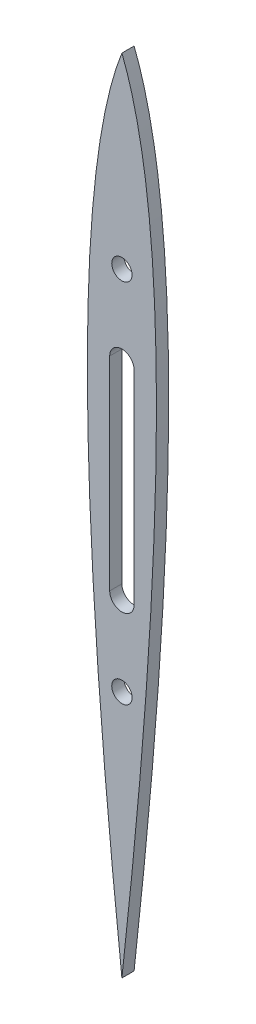
ISO-10303-21;
HEADER;
FILE_DESCRIPTION(('STEP AP214'),'2;1');
FILE_NAME('part.step','',(''),(''),'','','');
FILE_SCHEMA(('AUTOMOTIVE_DESIGN { 1 0 10303 214 1 1 1 1 }'));
ENDSEC;
DATA;
#1=APPLICATION_CONTEXT('core data for automotive mechanical design processes');
#2=APPLICATION_PROTOCOL_DEFINITION('international standard','automotive_design',2000,#1);
#3=PRODUCT_CONTEXT('',#1,'mechanical');
#4=PRODUCT('Part','Part','',(#3));
#5=PRODUCT_RELATED_PRODUCT_CATEGORY('part','',(#4));
#6=PRODUCT_DEFINITION_FORMATION('','',#4);
#7=PRODUCT_DEFINITION_CONTEXT('part definition',#1,'design');
#8=PRODUCT_DEFINITION('design','',#6,#7);
#9=PRODUCT_DEFINITION_SHAPE('','',#8);
#10=(LENGTH_UNIT() NAMED_UNIT(*) SI_UNIT(.MILLI.,.METRE.));
#11=(NAMED_UNIT(*) PLANE_ANGLE_UNIT() SI_UNIT($,.RADIAN.));
#12=(NAMED_UNIT(*) SI_UNIT($,.STERADIAN.) SOLID_ANGLE_UNIT());
#13=UNCERTAINTY_MEASURE_WITH_UNIT(LENGTH_MEASURE(1.E-05),#10,'distance_accuracy_value','');
#14=(GEOMETRIC_REPRESENTATION_CONTEXT(3) GLOBAL_UNCERTAINTY_ASSIGNED_CONTEXT((#13)) GLOBAL_UNIT_ASSIGNED_CONTEXT((#10,
#11,#12)) REPRESENTATION_CONTEXT('',''));
#15=CARTESIAN_POINT('',(0.,0.,0.));
#16=DIRECTION('',(0.,0.,1.));
#17=DIRECTION('',(1.,0.,0.));
#18=AXIS2_PLACEMENT_3D('',#15,#16,#17);
#19=CARTESIAN_POINT('',(-10.7943995780546,51.7617177266324,3.81));
#20=DIRECTION('',(0.,0.,1.));
#21=DIRECTION('',(1.,0.,0.));
#22=AXIS2_PLACEMENT_3D('',#19,#20,#21);
#23=PLANE('',#22);
#24=DIRECTION('',(0.,-1.,0.));
#25=VECTOR('',#24,1.);
#26=CARTESIAN_POINT('',(-3.81,57.15,3.81));
#27=LINE('',#26,#25);
#28=CARTESIAN_POINT('',(-3.81,57.15,3.81));
#29=VERTEX_POINT('',#28);
#30=CARTESIAN_POINT('',(-3.80999999999998,-6.35,3.81));
#31=VERTEX_POINT('',#30);
#32=EDGE_CURVE('E103',#29,#31,#27,.T.);
#33=ORIENTED_EDGE('',*,*,#32,.F.);
#34=CARTESIAN_POINT('',(0.,57.15,3.81));
#35=DIRECTION('',(0.,0.,1.));
#36=DIRECTION('',(1.,0.,0.));
#37=AXIS2_PLACEMENT_3D('',#34,#35,#36);
#38=CIRCLE('',#37,3.80999999999999);
#39=CARTESIAN_POINT('',(3.80999999999998,57.15,3.81));
#40=VERTEX_POINT('',#39);
#41=EDGE_CURVE('E94',#40,#29,#38,.T.);
#42=ORIENTED_EDGE('',*,*,#41,.F.);
#43=DIRECTION('',(0.,1.,0.));
#44=VECTOR('',#43,1.);
#45=CARTESIAN_POINT('',(3.80999999999998,57.15,3.81));
#46=LINE('',#45,#44);
#47=CARTESIAN_POINT('',(3.81,-6.35,3.81));
#48=VERTEX_POINT('',#47);
#49=EDGE_CURVE('E121',#48,#40,#46,.T.);
#50=ORIENTED_EDGE('',*,*,#49,.F.);
#51=CARTESIAN_POINT('',(0.,-6.35,3.81));
#52=DIRECTION('',(0.,0.,1.));
#53=DIRECTION('',(1.,0.,0.));
#54=AXIS2_PLACEMENT_3D('',#51,#52,#53);
#55=CIRCLE('',#54,3.80999999999999);
#56=EDGE_CURVE('E117',#31,#48,#55,.T.);
#57=ORIENTED_EDGE('',*,*,#56,.F.);
#58=EDGE_LOOP('',(#33,#42,#50,#57));
#59=FACE_BOUND('',#58,.T.);
#60=CARTESIAN_POINT('',(0.,-31.75,3.81));
#61=DIRECTION('',(0.,0.,1.));
#62=DIRECTION('',(1.,0.,0.));
#63=AXIS2_PLACEMENT_3D('',#60,#61,#62);
#64=CIRCLE('',#63,3.175);
#65=CARTESIAN_POINT('',(-3.175,-31.75,3.81));
#66=VERTEX_POINT('',#65);
#67=EDGE_CURVE('E145',#66,#66,#64,.T.);
#68=ORIENTED_EDGE('',*,*,#67,.F.);
#69=EDGE_LOOP('',(#68));
#70=FACE_BOUND('',#69,.T.);
#71=CARTESIAN_POINT('',(0.,140.978035644635,3.81));
#72=CARTESIAN_POINT('',(-3.91848207404643,131.156065716608,3.81));
#73=CARTESIAN_POINT('',(-8.16937817155045,106.055563129853,3.81));
#74=CARTESIAN_POINT('',(-10.2425746417,81.4333456049166,3.81));
#75=CARTESIAN_POINT('',(-11.1456655969047,45.0401668444737,3.81));
#76=CARTESIAN_POINT('',(-8.16373796542806,-35.5088464124318,3.81));
#77=CARTESIAN_POINT('',(0.,-109.125318419714,3.81));
#78=B_SPLINE_CURVE_WITH_KNOTS('',2,(#71,#72,#73,#74,#75,#76,#77),.UNSPECIFIED.,.F.,.F.,(3,1,1,1,
1,3),(0.0455268147428228,0.207530569666544,0.315533072949025,0.423535576231506,
0.585539331155228,0.909546841002671),.UNSPECIFIED.);
#79=CARTESIAN_POINT('',(0.,140.978035644634,3.81));
#80=VERTEX_POINT('',#79);
#81=CARTESIAN_POINT('',(0.,-109.125318419714,3.81));
#82=VERTEX_POINT('',#81);
#83=EDGE_CURVE('E152',#80,#82,#78,.T.);
#84=ORIENTED_EDGE('',*,*,#83,.T.);
#85=CARTESIAN_POINT('',(0.,-109.125318419714,3.81));
#86=CARTESIAN_POINT('',(8.16373796542807,-35.5088464124318,3.81));
#87=CARTESIAN_POINT('',(11.1456655969047,45.0401668444738,3.81));
#88=CARTESIAN_POINT('',(10.2425746417,81.4333456049166,3.81));
#89=CARTESIAN_POINT('',(8.16937817155045,106.055563129854,3.81));
#90=CARTESIAN_POINT('',(3.91848207404641,131.156065716608,3.81));
#91=CARTESIAN_POINT('',(0.,140.978035644634,3.81));
#92=B_SPLINE_CURVE_WITH_KNOTS('',2,(#85,#86,#87,#88,#89,#90,#91),.UNSPECIFIED.,.F.,.F.,(3,1,1,1,
1,3),(0.0455268147428226,0.369534324590266,0.531538079513987,0.639540582796468,
0.747543086078949,0.909546841002671),.UNSPECIFIED.);
#93=EDGE_CURVE('E159',#82,#80,#92,.T.);
#94=ORIENTED_EDGE('',*,*,#93,.T.);
#95=EDGE_LOOP('',(#84,#94));
#96=FACE_BOUND('',#95,.T.);
#97=CARTESIAN_POINT('',(0.,82.55,3.81));
#98=DIRECTION('',(0.,0.,1.));
#99=DIRECTION('',(1.,0.,0.));
#100=AXIS2_PLACEMENT_3D('',#97,#98,#99);
#101=CIRCLE('',#100,3.175);
#102=CARTESIAN_POINT('',(-3.175,82.55,3.81));
#103=VERTEX_POINT('',#102);
#104=EDGE_CURVE('E129',#103,#103,#101,.T.);
#105=ORIENTED_EDGE('',*,*,#104,.F.);
#106=EDGE_LOOP('',(#105));
#107=FACE_BOUND('',#106,.T.);
#108=ADVANCED_FACE('F39',(#59,#70,#96,#107),#23,.T.);
#109=CARTESIAN_POINT('',(-10.7943995780546,51.7617177266324,0.));
#110=DIRECTION('',(0.,0.,1.));
#111=DIRECTION('',(1.,0.,0.));
#112=AXIS2_PLACEMENT_3D('',#109,#110,#111);
#113=PLANE('',#112);
#114=CARTESIAN_POINT('',(0.,-31.75,0.));
#115=DIRECTION('',(0.,0.,1.));
#116=DIRECTION('',(1.,0.,0.));
#117=AXIS2_PLACEMENT_3D('',#114,#115,#116);
#118=CIRCLE('',#117,3.175);
#119=CARTESIAN_POINT('',(-3.175,-31.75,0.));
#120=VERTEX_POINT('',#119);
#121=EDGE_CURVE('E112',#120,#120,#118,.T.);
#122=ORIENTED_EDGE('',*,*,#121,.T.);
#123=EDGE_LOOP('',(#122));
#124=FACE_BOUND('',#123,.T.);
#125=CARTESIAN_POINT('',(0.,140.978035644635,0.));
#126=CARTESIAN_POINT('',(-3.91848207404643,131.156065716608,0.));
#127=CARTESIAN_POINT('',(-8.16937817155045,106.055563129853,0.));
#128=CARTESIAN_POINT('',(-10.2425746417,81.4333456049166,0.));
#129=CARTESIAN_POINT('',(-11.1456655969047,45.0401668444737,0.));
#130=CARTESIAN_POINT('',(-8.16373796542806,-35.5088464124318,0.));
#131=CARTESIAN_POINT('',(0.,-109.125318419714,0.));
#132=B_SPLINE_CURVE_WITH_KNOTS('',2,(#125,#126,#127,#128,#129,#130,#131),.UNSPECIFIED.,.F.,.F.,
(3,1,1,1,1,3),(0.0455268147428228,0.207530569666544,0.315533072949025,0.423535576231506,
0.585539331155228,0.909546841002671),.UNSPECIFIED.);
#133=CARTESIAN_POINT('',(0.,140.978035644634,0.));
#134=VERTEX_POINT('',#133);
#135=CARTESIAN_POINT('',(0.,-109.125318419714,0.));
#136=VERTEX_POINT('',#135);
#137=EDGE_CURVE('E149',#134,#136,#132,.T.);
#138=ORIENTED_EDGE('',*,*,#137,.F.);
#139=CARTESIAN_POINT('',(0.,-109.125318419714,0.));
#140=CARTESIAN_POINT('',(8.16373796542807,-35.5088464124318,0.));
#141=CARTESIAN_POINT('',(11.1456655969047,45.0401668444738,0.));
#142=CARTESIAN_POINT('',(10.2425746417,81.4333456049166,0.));
#143=CARTESIAN_POINT('',(8.16937817155045,106.055563129854,0.));
#144=CARTESIAN_POINT('',(3.91848207404641,131.156065716608,0.));
#145=CARTESIAN_POINT('',(0.,140.978035644634,0.));
#146=B_SPLINE_CURVE_WITH_KNOTS('',2,(#139,#140,#141,#142,#143,#144,#145),.UNSPECIFIED.,.F.,.F.,
(3,1,1,1,1,3),(0.0455268147428226,0.369534324590266,0.531538079513987,0.639540582796468,
0.747543086078949,0.909546841002671),.UNSPECIFIED.);
#147=EDGE_CURVE('E160',#136,#134,#146,.T.);
#148=ORIENTED_EDGE('',*,*,#147,.F.);
#149=EDGE_LOOP('',(#138,#148));
#150=FACE_BOUND('',#149,.T.);
#151=CARTESIAN_POINT('',(0.,57.15,0.));
#152=DIRECTION('',(0.,0.,1.));
#153=DIRECTION('',(1.,0.,0.));
#154=AXIS2_PLACEMENT_3D('',#151,#152,#153);
#155=CIRCLE('',#154,3.80999999999999);
#156=CARTESIAN_POINT('',(3.80999999999998,57.15,0.));
#157=VERTEX_POINT('',#156);
#158=CARTESIAN_POINT('',(-3.81,57.15,0.));
#159=VERTEX_POINT('',#158);
#160=EDGE_CURVE('E64',#157,#159,#155,.T.);
#161=ORIENTED_EDGE('',*,*,#160,.T.);
#162=DIRECTION('',(0.,-1.,0.));
#163=VECTOR('',#162,1.);
#164=CARTESIAN_POINT('',(-3.81,57.15,0.));
#165=LINE('',#164,#163);
#166=CARTESIAN_POINT('',(-3.80999999999998,-6.35,0.));
#167=VERTEX_POINT('',#166);
#168=EDGE_CURVE('E110',#159,#167,#165,.T.);
#169=ORIENTED_EDGE('',*,*,#168,.T.);
#170=CARTESIAN_POINT('',(0.,-6.35,0.));
#171=DIRECTION('',(0.,0.,1.));
#172=DIRECTION('',(1.,0.,0.));
#173=AXIS2_PLACEMENT_3D('',#170,#171,#172);
#174=CIRCLE('',#173,3.80999999999999);
#175=CARTESIAN_POINT('',(3.81,-6.35,0.));
#176=VERTEX_POINT('',#175);
#177=EDGE_CURVE('E132',#167,#176,#174,.T.);
#178=ORIENTED_EDGE('',*,*,#177,.T.);
#179=DIRECTION('',(0.,1.,0.));
#180=VECTOR('',#179,1.);
#181=CARTESIAN_POINT('',(3.80999999999998,57.15,0.));
#182=LINE('',#181,#180);
#183=EDGE_CURVE('E104',#176,#157,#182,.T.);
#184=ORIENTED_EDGE('',*,*,#183,.T.);
#185=EDGE_LOOP('',(#161,#169,#178,#184));
#186=FACE_BOUND('',#185,.T.);
#187=CARTESIAN_POINT('',(0.,82.55,0.));
#188=DIRECTION('',(0.,0.,1.));
#189=DIRECTION('',(1.,0.,0.));
#190=AXIS2_PLACEMENT_3D('',#187,#188,#189);
#191=CIRCLE('',#190,3.175);
#192=CARTESIAN_POINT('',(-3.175,82.55,0.));
#193=VERTEX_POINT('',#192);
#194=EDGE_CURVE('E210',#193,#193,#191,.T.);
#195=ORIENTED_EDGE('',*,*,#194,.T.);
#196=EDGE_LOOP('',(#195));
#197=FACE_BOUND('',#196,.T.);
#198=ADVANCED_FACE('F180',(#124,#150,#186,#197),#113,.F.);
#199=DIRECTION('',(0.,0.,-1.));
#200=VECTOR('',#199,1.);
#201=SURFACE_OF_LINEAR_EXTRUSION('',#78,#200);
#202=ORIENTED_EDGE('',*,*,#137,.T.);
#203=DIRECTION('',(0.,0.,-1.));
#204=VECTOR('',#203,1.);
#205=CARTESIAN_POINT('',(0.,-109.125318419714,3.81));
#206=LINE('',#205,#204);
#207=EDGE_CURVE('E11',#82,#136,#206,.T.);
#208=ORIENTED_EDGE('',*,*,#207,.F.);
#209=ORIENTED_EDGE('',*,*,#83,.F.);
#210=DIRECTION('',(0.,0.,-1.));
#211=VECTOR('',#210,1.);
#212=CARTESIAN_POINT('',(0.,140.978035644634,3.81));
#213=LINE('',#212,#211);
#214=EDGE_CURVE('E49',#80,#134,#213,.T.);
#215=ORIENTED_EDGE('',*,*,#214,.T.);
#216=EDGE_LOOP('',(#202,#208,#209,#215));
#217=FACE_BOUND('',#216,.T.);
#218=ADVANCED_FACE('F41',(#217),#201,.F.);
#219=DIRECTION('',(0.,0.,-1.));
#220=VECTOR('',#219,1.);
#221=SURFACE_OF_LINEAR_EXTRUSION('',#92,#220);
#222=ORIENTED_EDGE('',*,*,#147,.T.);
#223=ORIENTED_EDGE('',*,*,#214,.F.);
#224=ORIENTED_EDGE('',*,*,#93,.F.);
#225=ORIENTED_EDGE('',*,*,#207,.T.);
#226=EDGE_LOOP('',(#222,#223,#224,#225));
#227=FACE_BOUND('',#226,.T.);
#228=ADVANCED_FACE('F175',(#227),#221,.F.);
#229=CARTESIAN_POINT('',(0.,-31.75,3.81));
#230=DIRECTION('',(0.,0.,-1.));
#231=DIRECTION('',(-1.,0.,0.));
#232=AXIS2_PLACEMENT_3D('',#229,#230,#231);
#233=CYLINDRICAL_SURFACE('',#232,3.175);
#234=CARTESIAN_POINT('',(-3.175,-31.75,3.81));
#235=CARTESIAN_POINT('',(-3.175,-31.75,3.7703125));
#236=CARTESIAN_POINT('',(-3.175,-31.75,3.730625));
#237=CARTESIAN_POINT('',(-3.175,-31.75,3.65125));
#238=CARTESIAN_POINT('',(-3.175,-31.75,3.6115625));
#239=CARTESIAN_POINT('',(-3.175,-31.75,3.5321875));
#240=CARTESIAN_POINT('',(-3.175,-31.75,3.4925));
#241=CARTESIAN_POINT('',(-3.175,-31.75,3.413125));
#242=CARTESIAN_POINT('',(-3.175,-31.75,3.3734375));
#243=CARTESIAN_POINT('',(-3.175,-31.75,3.2940625));
#244=CARTESIAN_POINT('',(-3.175,-31.75,3.254375));
#245=CARTESIAN_POINT('',(-3.175,-31.75,3.175));
#246=CARTESIAN_POINT('',(-3.175,-31.75,3.1353125));
#247=CARTESIAN_POINT('',(-3.175,-31.75,3.0559375));
#248=CARTESIAN_POINT('',(-3.175,-31.75,3.01625));
#249=CARTESIAN_POINT('',(-3.175,-31.75,2.936875));
#250=CARTESIAN_POINT('',(-3.175,-31.75,2.8971875));
#251=CARTESIAN_POINT('',(-3.175,-31.75,2.8178125));
#252=CARTESIAN_POINT('',(-3.175,-31.75,2.778125));
#253=CARTESIAN_POINT('',(-3.175,-31.75,2.69875));
#254=CARTESIAN_POINT('',(-3.175,-31.75,2.6590625));
#255=CARTESIAN_POINT('',(-3.175,-31.75,2.5796875));
#256=CARTESIAN_POINT('',(-3.175,-31.75,2.54));
#257=CARTESIAN_POINT('',(-3.175,-31.75,2.460625));
#258=CARTESIAN_POINT('',(-3.175,-31.75,2.4209375));
#259=CARTESIAN_POINT('',(-3.175,-31.75,2.3415625));
#260=CARTESIAN_POINT('',(-3.175,-31.75,2.301875));
#261=CARTESIAN_POINT('',(-3.175,-31.75,2.2225));
#262=CARTESIAN_POINT('',(-3.175,-31.75,2.1828125));
#263=CARTESIAN_POINT('',(-3.175,-31.75,2.1034375));
#264=CARTESIAN_POINT('',(-3.175,-31.75,2.06375));
#265=CARTESIAN_POINT('',(-3.175,-31.75,1.984375));
#266=CARTESIAN_POINT('',(-3.175,-31.75,1.9446875));
#267=CARTESIAN_POINT('',(-3.175,-31.75,1.8653125));
#268=CARTESIAN_POINT('',(-3.175,-31.75,1.825625));
#269=CARTESIAN_POINT('',(-3.175,-31.75,1.74625));
#270=CARTESIAN_POINT('',(-3.175,-31.75,1.7065625));
#271=CARTESIAN_POINT('',(-3.175,-31.75,1.6271875));
#272=CARTESIAN_POINT('',(-3.175,-31.75,1.5875));
#273=CARTESIAN_POINT('',(-3.175,-31.75,1.508125));
#274=CARTESIAN_POINT('',(-3.175,-31.75,1.4684375));
#275=CARTESIAN_POINT('',(-3.175,-31.75,1.3890625));
#276=CARTESIAN_POINT('',(-3.175,-31.75,1.349375));
#277=CARTESIAN_POINT('',(-3.175,-31.75,1.27));
#278=CARTESIAN_POINT('',(-3.175,-31.75,1.2303125));
#279=CARTESIAN_POINT('',(-3.175,-31.75,1.1509375));
#280=CARTESIAN_POINT('',(-3.175,-31.75,1.11125));
#281=CARTESIAN_POINT('',(-3.175,-31.75,1.031875));
#282=CARTESIAN_POINT('',(-3.175,-31.75,0.9921875));
#283=CARTESIAN_POINT('',(-3.175,-31.75,0.9128125));
#284=CARTESIAN_POINT('',(-3.175,-31.75,0.873125));
#285=CARTESIAN_POINT('',(-3.175,-31.75,0.79375));
#286=CARTESIAN_POINT('',(-3.175,-31.75,0.7540625));
#287=CARTESIAN_POINT('',(-3.175,-31.75,0.6746875));
#288=CARTESIAN_POINT('',(-3.175,-31.75,0.635));
#289=CARTESIAN_POINT('',(-3.175,-31.75,0.555625));
#290=CARTESIAN_POINT('',(-3.175,-31.75,0.5159375));
#291=CARTESIAN_POINT('',(-3.175,-31.75,0.4365625));
#292=CARTESIAN_POINT('',(-3.175,-31.75,0.396875));
#293=CARTESIAN_POINT('',(-3.175,-31.75,0.3175));
#294=CARTESIAN_POINT('',(-3.175,-31.75,0.2778125));
#295=CARTESIAN_POINT('',(-3.175,-31.75,0.1984375));
#296=CARTESIAN_POINT('',(-3.175,-31.75,0.15875));
#297=CARTESIAN_POINT('',(-3.175,-31.75,0.0793749999999999));
#298=CARTESIAN_POINT('',(-3.175,-31.75,0.0396874999999999));
#299=CARTESIAN_POINT('',(-3.175,-31.75,0.));
#300=B_SPLINE_CURVE_WITH_KNOTS('',3,(#234,#235,#236,#237,#238,#239,#240,#241,#242,#243,#244,
#245,#246,#247,#248,#249,#250,#251,#252,#253,#254,#255,#256,#257,#258,#259,#260,#261,#262,#263,
#264,#265,#266,#267,#268,#269,#270,#271,#272,#273,#274,#275,#276,#277,#278,#279,#280,#281,#282,
#283,#284,#285,#286,#287,#288,#289,#290,#291,#292,#293,#294,#295,#296,#297,#298,#299),
.UNSPECIFIED.,.F.,.F.,(4,2,2,2,2,2,2,2,2,2,2,2,2,2,2,2,2,2,2,2,2,2,2,2,2,2,2,2,2,2,2,2,4),(0.,
0.1190625,0.238125,0.3571875,0.47625,0.595312499999999,0.714375,0.833437499999999,
0.952499999999999,1.0715625,1.190625,1.3096875,1.42875,1.5478125,1.666875,1.7859375,1.905,
2.0240625,2.143125,2.2621875,2.38125,2.5003125,2.619375,2.7384375,2.8575,2.9765625,3.095625,
3.2146875,3.33375,3.4528125,3.571875,3.6909375,3.81),.UNSPECIFIED.);
#301=EDGE_CURVE('BSEAM178',#66,#120,#300,.T.);
#302=ORIENTED_EDGE('',*,*,#67,.T.);
#303=ORIENTED_EDGE('',*,*,#121,.F.);
#304=ORIENTED_EDGE('',*,*,#301,.T.);
#305=ORIENTED_EDGE('',*,*,#301,.F.);
#306=EDGE_LOOP('',(#302,#304,#303,#305));
#307=FACE_BOUND('',#306,.T.);
#308=ADVANCED_FACE('F178',(#307),#233,.F.);
#309=CARTESIAN_POINT('',(0.,57.15,3.81));
#310=DIRECTION('',(0.,0.,-1.));
#311=DIRECTION('',(-1.,0.,0.));
#312=AXIS2_PLACEMENT_3D('',#309,#310,#311);
#313=CYLINDRICAL_SURFACE('',#312,3.80999999999999);
#314=ORIENTED_EDGE('',*,*,#160,.F.);
#315=DIRECTION('',(0.,0.,-1.));
#316=VECTOR('',#315,1.);
#317=CARTESIAN_POINT('',(3.80999999999998,57.15,3.81));
#318=LINE('',#317,#316);
#319=EDGE_CURVE('E98',#40,#157,#318,.T.);
#320=ORIENTED_EDGE('',*,*,#319,.F.);
#321=ORIENTED_EDGE('',*,*,#41,.T.);
#322=DIRECTION('',(0.,0.,-1.));
#323=VECTOR('',#322,1.);
#324=CARTESIAN_POINT('',(-3.81,57.15,3.81));
#325=LINE('',#324,#323);
#326=EDGE_CURVE('E97',#29,#159,#325,.T.);
#327=ORIENTED_EDGE('',*,*,#326,.T.);
#328=EDGE_LOOP('',(#314,#320,#321,#327));
#329=FACE_BOUND('',#328,.T.);
#330=ADVANCED_FACE('F96',(#329),#313,.F.);
#331=CARTESIAN_POINT('',(-3.81,57.15,3.81));
#332=DIRECTION('',(1.,0.,0.));
#333=DIRECTION('',(0.,1.,0.));
#334=AXIS2_PLACEMENT_3D('',#331,#332,#333);
#335=PLANE('',#334);
#336=ORIENTED_EDGE('',*,*,#168,.F.);
#337=ORIENTED_EDGE('',*,*,#326,.F.);
#338=ORIENTED_EDGE('',*,*,#32,.T.);
#339=DIRECTION('',(0.,0.,-1.));
#340=VECTOR('',#339,1.);
#341=CARTESIAN_POINT('',(-3.80999999999998,-6.35,3.81));
#342=LINE('',#341,#340);
#343=EDGE_CURVE('E113',#31,#167,#342,.T.);
#344=ORIENTED_EDGE('',*,*,#343,.T.);
#345=EDGE_LOOP('',(#336,#337,#338,#344));
#346=FACE_BOUND('',#345,.T.);
#347=ADVANCED_FACE('F107',(#346),#335,.T.);
#348=CARTESIAN_POINT('',(0.,-6.35,3.81));
#349=DIRECTION('',(0.,0.,-1.));
#350=DIRECTION('',(-1.,0.,0.));
#351=AXIS2_PLACEMENT_3D('',#348,#349,#350);
#352=CYLINDRICAL_SURFACE('',#351,3.80999999999999);
#353=ORIENTED_EDGE('',*,*,#177,.F.);
#354=ORIENTED_EDGE('',*,*,#343,.F.);
#355=ORIENTED_EDGE('',*,*,#56,.T.);
#356=DIRECTION('',(0.,0.,-1.));
#357=VECTOR('',#356,1.);
#358=CARTESIAN_POINT('',(3.81,-6.35,3.81));
#359=LINE('',#358,#357);
#360=EDGE_CURVE('E56',#48,#176,#359,.T.);
#361=ORIENTED_EDGE('',*,*,#360,.T.);
#362=EDGE_LOOP('',(#353,#354,#355,#361));
#363=FACE_BOUND('',#362,.T.);
#364=ADVANCED_FACE('F193',(#363),#352,.F.);
#365=CARTESIAN_POINT('',(3.80999999999998,57.15,3.81));
#366=DIRECTION('',(-1.,0.,0.));
#367=DIRECTION('',(0.,-1.,0.));
#368=AXIS2_PLACEMENT_3D('',#365,#366,#367);
#369=PLANE('',#368);
#370=ORIENTED_EDGE('',*,*,#183,.F.);
#371=ORIENTED_EDGE('',*,*,#360,.F.);
#372=ORIENTED_EDGE('',*,*,#49,.T.);
#373=ORIENTED_EDGE('',*,*,#319,.T.);
#374=EDGE_LOOP('',(#370,#371,#372,#373));
#375=FACE_BOUND('',#374,.T.);
#376=ADVANCED_FACE('F196',(#375),#369,.T.);
#377=CARTESIAN_POINT('',(0.,82.55,3.81));
#378=DIRECTION('',(0.,0.,-1.));
#379=DIRECTION('',(-1.,0.,0.));
#380=AXIS2_PLACEMENT_3D('',#377,#378,#379);
#381=CYLINDRICAL_SURFACE('',#380,3.175);
#382=CARTESIAN_POINT('',(-3.175,82.55,3.81));
#383=CARTESIAN_POINT('',(-3.175,82.55,3.7703125));
#384=CARTESIAN_POINT('',(-3.175,82.55,3.730625));
#385=CARTESIAN_POINT('',(-3.175,82.55,3.65125));
#386=CARTESIAN_POINT('',(-3.175,82.55,3.6115625));
#387=CARTESIAN_POINT('',(-3.175,82.55,3.5321875));
#388=CARTESIAN_POINT('',(-3.175,82.55,3.4925));
#389=CARTESIAN_POINT('',(-3.175,82.55,3.413125));
#390=CARTESIAN_POINT('',(-3.175,82.55,3.3734375));
#391=CARTESIAN_POINT('',(-3.175,82.55,3.2940625));
#392=CARTESIAN_POINT('',(-3.175,82.55,3.254375));
#393=CARTESIAN_POINT('',(-3.175,82.55,3.175));
#394=CARTESIAN_POINT('',(-3.175,82.55,3.1353125));
#395=CARTESIAN_POINT('',(-3.175,82.55,3.0559375));
#396=CARTESIAN_POINT('',(-3.175,82.55,3.01625));
#397=CARTESIAN_POINT('',(-3.175,82.55,2.936875));
#398=CARTESIAN_POINT('',(-3.175,82.55,2.8971875));
#399=CARTESIAN_POINT('',(-3.175,82.55,2.8178125));
#400=CARTESIAN_POINT('',(-3.175,82.55,2.778125));
#401=CARTESIAN_POINT('',(-3.175,82.55,2.69875));
#402=CARTESIAN_POINT('',(-3.175,82.55,2.6590625));
#403=CARTESIAN_POINT('',(-3.175,82.55,2.5796875));
#404=CARTESIAN_POINT('',(-3.175,82.55,2.54));
#405=CARTESIAN_POINT('',(-3.175,82.55,2.460625));
#406=CARTESIAN_POINT('',(-3.175,82.55,2.4209375));
#407=CARTESIAN_POINT('',(-3.175,82.55,2.3415625));
#408=CARTESIAN_POINT('',(-3.175,82.55,2.301875));
#409=CARTESIAN_POINT('',(-3.175,82.55,2.2225));
#410=CARTESIAN_POINT('',(-3.175,82.55,2.1828125));
#411=CARTESIAN_POINT('',(-3.175,82.55,2.1034375));
#412=CARTESIAN_POINT('',(-3.175,82.55,2.06375));
#413=CARTESIAN_POINT('',(-3.175,82.55,1.984375));
#414=CARTESIAN_POINT('',(-3.175,82.55,1.9446875));
#415=CARTESIAN_POINT('',(-3.175,82.55,1.8653125));
#416=CARTESIAN_POINT('',(-3.175,82.55,1.825625));
#417=CARTESIAN_POINT('',(-3.175,82.55,1.74625));
#418=CARTESIAN_POINT('',(-3.175,82.55,1.7065625));
#419=CARTESIAN_POINT('',(-3.175,82.55,1.6271875));
#420=CARTESIAN_POINT('',(-3.175,82.55,1.5875));
#421=CARTESIAN_POINT('',(-3.175,82.55,1.508125));
#422=CARTESIAN_POINT('',(-3.175,82.55,1.4684375));
#423=CARTESIAN_POINT('',(-3.175,82.55,1.3890625));
#424=CARTESIAN_POINT('',(-3.175,82.55,1.349375));
#425=CARTESIAN_POINT('',(-3.175,82.55,1.27));
#426=CARTESIAN_POINT('',(-3.175,82.55,1.2303125));
#427=CARTESIAN_POINT('',(-3.175,82.55,1.1509375));
#428=CARTESIAN_POINT('',(-3.175,82.55,1.11125));
#429=CARTESIAN_POINT('',(-3.175,82.55,1.031875));
#430=CARTESIAN_POINT('',(-3.175,82.55,0.9921875));
#431=CARTESIAN_POINT('',(-3.175,82.55,0.9128125));
#432=CARTESIAN_POINT('',(-3.175,82.55,0.873125));
#433=CARTESIAN_POINT('',(-3.175,82.55,0.79375));
#434=CARTESIAN_POINT('',(-3.175,82.55,0.7540625));
#435=CARTESIAN_POINT('',(-3.175,82.55,0.6746875));
#436=CARTESIAN_POINT('',(-3.175,82.55,0.635));
#437=CARTESIAN_POINT('',(-3.175,82.55,0.555625));
#438=CARTESIAN_POINT('',(-3.175,82.55,0.5159375));
#439=CARTESIAN_POINT('',(-3.175,82.55,0.4365625));
#440=CARTESIAN_POINT('',(-3.175,82.55,0.396875));
#441=CARTESIAN_POINT('',(-3.175,82.55,0.3175));
#442=CARTESIAN_POINT('',(-3.175,82.55,0.2778125));
#443=CARTESIAN_POINT('',(-3.175,82.55,0.1984375));
#444=CARTESIAN_POINT('',(-3.175,82.55,0.15875));
#445=CARTESIAN_POINT('',(-3.175,82.55,0.0793749999999999));
#446=CARTESIAN_POINT('',(-3.175,82.55,0.0396874999999999));
#447=CARTESIAN_POINT('',(-3.175,82.55,0.));
#448=B_SPLINE_CURVE_WITH_KNOTS('',3,(#382,#383,#384,#385,#386,#387,#388,#389,#390,#391,#392,
#393,#394,#395,#396,#397,#398,#399,#400,#401,#402,#403,#404,#405,#406,#407,#408,#409,#410,#411,
#412,#413,#414,#415,#416,#417,#418,#419,#420,#421,#422,#423,#424,#425,#426,#427,#428,#429,#430,
#431,#432,#433,#434,#435,#436,#437,#438,#439,#440,#441,#442,#443,#444,#445,#446,#447),
.UNSPECIFIED.,.F.,.F.,(4,2,2,2,2,2,2,2,2,2,2,2,2,2,2,2,2,2,2,2,2,2,2,2,2,2,2,2,2,2,2,2,4),(0.,
0.1190625,0.238125,0.3571875,0.47625,0.595312499999999,0.714375,0.833437499999999,
0.952499999999999,1.0715625,1.190625,1.3096875,1.42875,1.5478125,1.666875,1.7859375,1.905,
2.0240625,2.143125,2.2621875,2.38125,2.5003125,2.619375,2.7384375,2.8575,2.9765625,3.095625,
3.2146875,3.33375,3.4528125,3.571875,3.6909375,3.81),.UNSPECIFIED.);
#449=EDGE_CURVE('BSEAM200',#103,#193,#448,.T.);
#450=ORIENTED_EDGE('',*,*,#104,.T.);
#451=ORIENTED_EDGE('',*,*,#194,.F.);
#452=ORIENTED_EDGE('',*,*,#449,.T.);
#453=ORIENTED_EDGE('',*,*,#449,.F.);
#454=EDGE_LOOP('',(#450,#452,#451,#453));
#455=FACE_BOUND('',#454,.T.);
#456=ADVANCED_FACE('F200',(#455),#381,.F.);
#457=CLOSED_SHELL('',(#108,#198,#218,#228,#308,#330,#347,#364,#376,#456));
#458=MANIFOLD_SOLID_BREP('B2',#457);
#459=ADVANCED_BREP_SHAPE_REPRESENTATION('',(#18,#458),#14);
#460=SHAPE_DEFINITION_REPRESENTATION(#9,#459);
ENDSEC;
END-ISO-10303-21;
